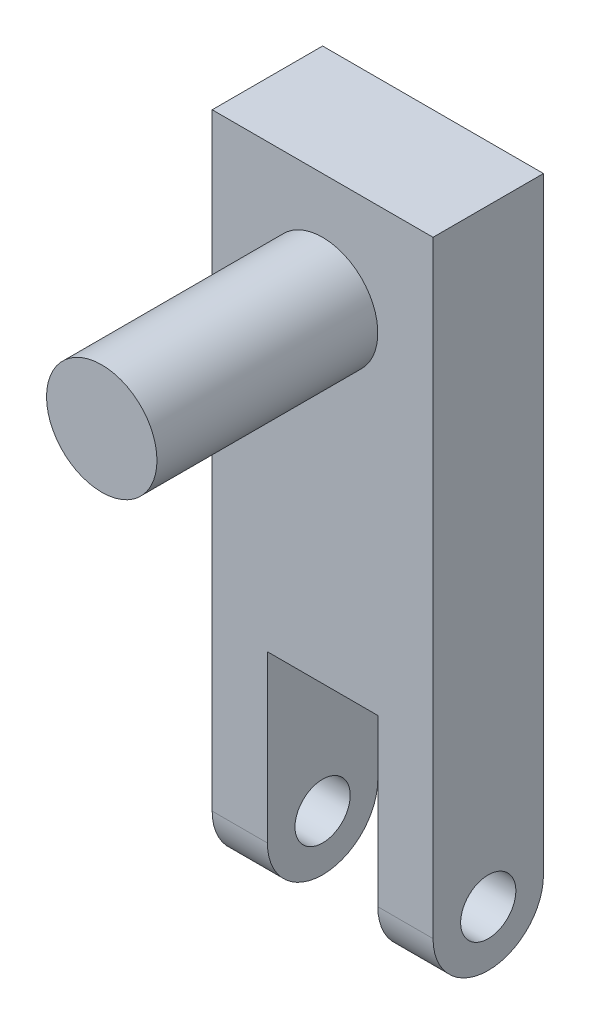
ISO-10303-21;
HEADER;
FILE_DESCRIPTION(('STEP AP214'),'2;1');
FILE_NAME('part.step','',(''),(''),'','','');
FILE_SCHEMA(('AUTOMOTIVE_DESIGN { 1 0 10303 214 1 1 1 1 }'));
ENDSEC;
DATA;
#1=APPLICATION_CONTEXT('core data for automotive mechanical design processes');
#2=APPLICATION_PROTOCOL_DEFINITION('international standard','automotive_design',2000,#1);
#3=PRODUCT_CONTEXT('',#1,'mechanical');
#4=PRODUCT('Part','Part','',(#3));
#5=PRODUCT_RELATED_PRODUCT_CATEGORY('part','',(#4));
#6=PRODUCT_DEFINITION_FORMATION('','',#4);
#7=PRODUCT_DEFINITION_CONTEXT('part definition',#1,'design');
#8=PRODUCT_DEFINITION('design','',#6,#7);
#9=PRODUCT_DEFINITION_SHAPE('','',#8);
#10=(LENGTH_UNIT() NAMED_UNIT(*) SI_UNIT(.MILLI.,.METRE.));
#11=(NAMED_UNIT(*) PLANE_ANGLE_UNIT() SI_UNIT($,.RADIAN.));
#12=(NAMED_UNIT(*) SI_UNIT($,.STERADIAN.) SOLID_ANGLE_UNIT());
#13=UNCERTAINTY_MEASURE_WITH_UNIT(LENGTH_MEASURE(1.E-05),#10,'distance_accuracy_value','');
#14=(GEOMETRIC_REPRESENTATION_CONTEXT(3) GLOBAL_UNCERTAINTY_ASSIGNED_CONTEXT((#13)) GLOBAL_UNIT_ASSIGNED_CONTEXT((#10,
#11,#12)) REPRESENTATION_CONTEXT('',''));
#15=CARTESIAN_POINT('',(0.,0.,0.));
#16=DIRECTION('',(0.,0.,1.));
#17=DIRECTION('',(1.,0.,0.));
#18=AXIS2_PLACEMENT_3D('',#15,#16,#17);
#19=CARTESIAN_POINT('',(-6.35,0.,6.35));
#20=DIRECTION('',(1.,0.,0.));
#21=DIRECTION('',(0.,0.,-1.));
#22=AXIS2_PLACEMENT_3D('',#19,#20,#21);
#23=PLANE('',#22);
#24=CARTESIAN_POINT('',(-6.35,3.175,3.175));
#25=DIRECTION('',(1.,0.,0.));
#26=DIRECTION('',(0.,0.,-1.));
#27=AXIS2_PLACEMENT_3D('',#24,#25,#26);
#28=CIRCLE('',#27,1.5875);
#29=CARTESIAN_POINT('',(-6.35,3.175,1.5875));
#30=VERTEX_POINT('',#29);
#31=EDGE_CURVE('E237',#30,#30,#28,.T.);
#32=ORIENTED_EDGE('',*,*,#31,.T.);
#33=EDGE_LOOP('',(#32));
#34=FACE_BOUND('',#33,.T.);
#35=DIRECTION('',(0.,-1.,0.));
#36=VECTOR('',#35,1.);
#37=CARTESIAN_POINT('',(-6.35,0.,0.));
#38=LINE('',#37,#36);
#39=CARTESIAN_POINT('',(-6.35,38.1,0.));
#40=VERTEX_POINT('',#39);
#41=CARTESIAN_POINT('',(-6.35,3.175,0.));
#42=VERTEX_POINT('',#41);
#43=EDGE_CURVE('E159',#40,#42,#38,.T.);
#44=ORIENTED_EDGE('',*,*,#43,.T.);
#45=CARTESIAN_POINT('',(-6.35,3.175,3.175));
#46=DIRECTION('',(1.,0.,0.));
#47=DIRECTION('',(0.,0.,-1.));
#48=AXIS2_PLACEMENT_3D('',#45,#46,#47);
#49=CIRCLE('',#48,3.175);
#50=CARTESIAN_POINT('',(-6.35,0.,3.175));
#51=VERTEX_POINT('',#50);
#52=EDGE_CURVE('E203',#42,#51,#49,.F.);
#53=ORIENTED_EDGE('',*,*,#52,.T.);
#54=CARTESIAN_POINT('',(-6.35,3.175,3.175));
#55=DIRECTION('',(1.,0.,0.));
#56=DIRECTION('',(0.,0.,-1.));
#57=AXIS2_PLACEMENT_3D('',#54,#55,#56);
#58=CIRCLE('',#57,3.175);
#59=CARTESIAN_POINT('',(-6.35,3.175,6.35));
#60=VERTEX_POINT('',#59);
#61=EDGE_CURVE('E200',#51,#60,#58,.F.);
#62=ORIENTED_EDGE('',*,*,#61,.T.);
#63=DIRECTION('',(0.,-1.,0.));
#64=VECTOR('',#63,1.);
#65=CARTESIAN_POINT('',(-6.35,0.,6.35));
#66=LINE('',#65,#64);
#67=CARTESIAN_POINT('',(-6.35,38.1,6.35));
#68=VERTEX_POINT('',#67);
#69=EDGE_CURVE('E129',#68,#60,#66,.T.);
#70=ORIENTED_EDGE('',*,*,#69,.F.);
#71=DIRECTION('',(0.,0.,-1.));
#72=VECTOR('',#71,1.);
#73=CARTESIAN_POINT('',(-6.35,38.1,6.35));
#74=LINE('',#73,#72);
#75=EDGE_CURVE('E158',#68,#40,#74,.T.);
#76=ORIENTED_EDGE('',*,*,#75,.T.);
#77=EDGE_LOOP('',(#44,#53,#62,#70,#76));
#78=FACE_BOUND('',#77,.T.);
#79=ADVANCED_FACE('F39',(#34,#78),#23,.F.);
#80=CARTESIAN_POINT('',(-3.175,0.,6.35));
#81=DIRECTION('',(-1.,0.,0.));
#82=DIRECTION('',(0.,0.,1.));
#83=AXIS2_PLACEMENT_3D('',#80,#81,#82);
#84=PLANE('',#83);
#85=CARTESIAN_POINT('',(-3.175,3.175,3.175));
#86=DIRECTION('',(-1.,0.,0.));
#87=DIRECTION('',(0.,0.,1.));
#88=AXIS2_PLACEMENT_3D('',#85,#86,#87);
#89=CIRCLE('',#88,1.5875);
#90=CARTESIAN_POINT('',(-3.175,3.175,4.7625));
#91=VERTEX_POINT('',#90);
#92=EDGE_CURVE('E226',#91,#91,#89,.T.);
#93=ORIENTED_EDGE('',*,*,#92,.T.);
#94=EDGE_LOOP('',(#93));
#95=FACE_BOUND('',#94,.T.);
#96=CARTESIAN_POINT('',(-3.175,3.175,3.175));
#97=DIRECTION('',(-1.,0.,0.));
#98=DIRECTION('',(0.,0.,1.));
#99=AXIS2_PLACEMENT_3D('',#96,#97,#98);
#100=CIRCLE('',#99,3.175);
#101=CARTESIAN_POINT('',(-3.175,3.175,6.35));
#102=VERTEX_POINT('',#101);
#103=CARTESIAN_POINT('',(-3.175,0.,3.175));
#104=VERTEX_POINT('',#103);
#105=EDGE_CURVE('E139',#102,#104,#100,.F.);
#106=ORIENTED_EDGE('',*,*,#105,.T.);
#107=CARTESIAN_POINT('',(-3.175,3.175,3.175));
#108=DIRECTION('',(-1.,0.,0.));
#109=DIRECTION('',(0.,0.,1.));
#110=AXIS2_PLACEMENT_3D('',#107,#108,#109);
#111=CIRCLE('',#110,3.175);
#112=CARTESIAN_POINT('',(-3.175,3.175,0.));
#113=VERTEX_POINT('',#112);
#114=EDGE_CURVE('E189',#104,#113,#111,.F.);
#115=ORIENTED_EDGE('',*,*,#114,.T.);
#116=DIRECTION('',(0.,1.,0.));
#117=VECTOR('',#116,1.);
#118=CARTESIAN_POINT('',(-3.175,0.,0.));
#119=LINE('',#118,#117);
#120=CARTESIAN_POINT('',(-3.175,12.7,0.));
#121=VERTEX_POINT('',#120);
#122=EDGE_CURVE('E135',#113,#121,#119,.T.);
#123=ORIENTED_EDGE('',*,*,#122,.T.);
#124=DIRECTION('',(0.,0.,-1.));
#125=VECTOR('',#124,1.);
#126=CARTESIAN_POINT('',(-3.175,12.7,6.35));
#127=LINE('',#126,#125);
#128=CARTESIAN_POINT('',(-3.175,12.7,6.35));
#129=VERTEX_POINT('',#128);
#130=EDGE_CURVE('E132',#129,#121,#127,.T.);
#131=ORIENTED_EDGE('',*,*,#130,.F.);
#132=DIRECTION('',(0.,1.,0.));
#133=VECTOR('',#132,1.);
#134=CARTESIAN_POINT('',(-3.175,0.,6.35));
#135=LINE('',#134,#133);
#136=EDGE_CURVE('E116',#102,#129,#135,.T.);
#137=ORIENTED_EDGE('',*,*,#136,.F.);
#138=EDGE_LOOP('',(#106,#115,#123,#131,#137));
#139=FACE_BOUND('',#138,.T.);
#140=ADVANCED_FACE('F133',(#95,#139),#84,.F.);
#141=CARTESIAN_POINT('',(-3.175,12.7,6.35));
#142=DIRECTION('',(0.,1.,0.));
#143=DIRECTION('',(-1.,0.,0.));
#144=AXIS2_PLACEMENT_3D('',#141,#142,#143);
#145=PLANE('',#144);
#146=DIRECTION('',(1.,0.,0.));
#147=VECTOR('',#146,1.);
#148=CARTESIAN_POINT('',(-3.175,12.7,0.));
#149=LINE('',#148,#147);
#150=CARTESIAN_POINT('',(3.175,12.7,0.));
#151=VERTEX_POINT('',#150);
#152=EDGE_CURVE('E166',#121,#151,#149,.T.);
#153=ORIENTED_EDGE('',*,*,#152,.T.);
#154=DIRECTION('',(0.,0.,-1.));
#155=VECTOR('',#154,1.);
#156=CARTESIAN_POINT('',(3.175,12.7,6.35));
#157=LINE('',#156,#155);
#158=CARTESIAN_POINT('',(3.175,12.7,6.35));
#159=VERTEX_POINT('',#158);
#160=EDGE_CURVE('E140',#159,#151,#157,.T.);
#161=ORIENTED_EDGE('',*,*,#160,.F.);
#162=DIRECTION('',(1.,0.,0.));
#163=VECTOR('',#162,1.);
#164=CARTESIAN_POINT('',(-3.175,12.7,6.35));
#165=LINE('',#164,#163);
#166=EDGE_CURVE('E122',#129,#159,#165,.T.);
#167=ORIENTED_EDGE('',*,*,#166,.F.);
#168=ORIENTED_EDGE('',*,*,#130,.T.);
#169=EDGE_LOOP('',(#153,#161,#167,#168));
#170=FACE_BOUND('',#169,.T.);
#171=ADVANCED_FACE('F142',(#170),#145,.F.);
#172=CARTESIAN_POINT('',(3.175,0.,6.35));
#173=DIRECTION('',(1.,0.,0.));
#174=DIRECTION('',(0.,0.,-1.));
#175=AXIS2_PLACEMENT_3D('',#172,#173,#174);
#176=PLANE('',#175);
#177=CARTESIAN_POINT('',(3.175,3.175,3.175));
#178=DIRECTION('',(1.,0.,0.));
#179=DIRECTION('',(0.,0.,-1.));
#180=AXIS2_PLACEMENT_3D('',#177,#178,#179);
#181=CIRCLE('',#180,1.5875);
#182=CARTESIAN_POINT('',(3.175,3.175,1.5875));
#183=VERTEX_POINT('',#182);
#184=EDGE_CURVE('E231',#183,#183,#181,.T.);
#185=ORIENTED_EDGE('',*,*,#184,.T.);
#186=EDGE_LOOP('',(#185));
#187=FACE_BOUND('',#186,.T.);
#188=DIRECTION('',(0.,-1.,0.));
#189=VECTOR('',#188,1.);
#190=CARTESIAN_POINT('',(3.175,0.,0.));
#191=LINE('',#190,#189);
#192=CARTESIAN_POINT('',(3.175,3.175,0.));
#193=VERTEX_POINT('',#192);
#194=EDGE_CURVE('E169',#151,#193,#191,.T.);
#195=ORIENTED_EDGE('',*,*,#194,.T.);
#196=CARTESIAN_POINT('',(3.175,3.175,3.175));
#197=DIRECTION('',(1.,0.,0.));
#198=DIRECTION('',(0.,0.,-1.));
#199=AXIS2_PLACEMENT_3D('',#196,#197,#198);
#200=CIRCLE('',#199,3.175);
#201=CARTESIAN_POINT('',(3.175,0.,3.175));
#202=VERTEX_POINT('',#201);
#203=EDGE_CURVE('E48',#193,#202,#200,.F.);
#204=ORIENTED_EDGE('',*,*,#203,.T.);
#205=CARTESIAN_POINT('',(3.175,3.175,3.175));
#206=DIRECTION('',(1.,0.,0.));
#207=DIRECTION('',(0.,0.,-1.));
#208=AXIS2_PLACEMENT_3D('',#205,#206,#207);
#209=CIRCLE('',#208,3.175);
#210=CARTESIAN_POINT('',(3.175,3.175,6.35));
#211=VERTEX_POINT('',#210);
#212=EDGE_CURVE('E216',#202,#211,#209,.F.);
#213=ORIENTED_EDGE('',*,*,#212,.T.);
#214=DIRECTION('',(0.,-1.,0.));
#215=VECTOR('',#214,1.);
#216=CARTESIAN_POINT('',(3.175,0.,6.35));
#217=LINE('',#216,#215);
#218=EDGE_CURVE('E146',#159,#211,#217,.T.);
#219=ORIENTED_EDGE('',*,*,#218,.F.);
#220=ORIENTED_EDGE('',*,*,#160,.T.);
#221=EDGE_LOOP('',(#195,#204,#213,#219,#220));
#222=FACE_BOUND('',#221,.T.);
#223=ADVANCED_FACE('F265',(#187,#222),#176,.F.);
#224=CARTESIAN_POINT('',(6.35,0.,6.35));
#225=DIRECTION('',(-1.,0.,0.));
#226=DIRECTION('',(0.,0.,1.));
#227=AXIS2_PLACEMENT_3D('',#224,#225,#226);
#228=PLANE('',#227);
#229=CARTESIAN_POINT('',(6.35,3.175,3.175));
#230=DIRECTION('',(1.,0.,0.));
#231=DIRECTION('',(0.,0.,-1.));
#232=AXIS2_PLACEMENT_3D('',#229,#230,#231);
#233=CIRCLE('',#232,1.5875);
#234=CARTESIAN_POINT('',(6.35,3.175,1.5875));
#235=VERTEX_POINT('',#234);
#236=EDGE_CURVE('E364',#235,#235,#233,.T.);
#237=ORIENTED_EDGE('',*,*,#236,.F.);
#238=EDGE_LOOP('',(#237));
#239=FACE_BOUND('',#238,.T.);
#240=CARTESIAN_POINT('',(6.35,3.175,3.175));
#241=DIRECTION('',(-1.,0.,0.));
#242=DIRECTION('',(0.,0.,1.));
#243=AXIS2_PLACEMENT_3D('',#240,#241,#242);
#244=CIRCLE('',#243,3.175);
#245=CARTESIAN_POINT('',(6.35,3.175,6.35));
#246=VERTEX_POINT('',#245);
#247=CARTESIAN_POINT('',(6.35,0.,3.175));
#248=VERTEX_POINT('',#247);
#249=EDGE_CURVE('E62',#246,#248,#244,.F.);
#250=ORIENTED_EDGE('',*,*,#249,.T.);
#251=CARTESIAN_POINT('',(6.35,3.175,3.175));
#252=DIRECTION('',(-1.,0.,0.));
#253=DIRECTION('',(0.,0.,1.));
#254=AXIS2_PLACEMENT_3D('',#251,#252,#253);
#255=CIRCLE('',#254,3.175);
#256=CARTESIAN_POINT('',(6.35,3.175,0.));
#257=VERTEX_POINT('',#256);
#258=EDGE_CURVE('E213',#248,#257,#255,.F.);
#259=ORIENTED_EDGE('',*,*,#258,.T.);
#260=DIRECTION('',(0.,1.,0.));
#261=VECTOR('',#260,1.);
#262=CARTESIAN_POINT('',(6.35,0.,0.));
#263=LINE('',#262,#261);
#264=CARTESIAN_POINT('',(6.35,38.1,0.));
#265=VERTEX_POINT('',#264);
#266=EDGE_CURVE('E172',#257,#265,#263,.T.);
#267=ORIENTED_EDGE('',*,*,#266,.T.);
#268=DIRECTION('',(0.,0.,-1.));
#269=VECTOR('',#268,1.);
#270=CARTESIAN_POINT('',(6.35,38.1,6.35));
#271=LINE('',#270,#269);
#272=CARTESIAN_POINT('',(6.35,38.1,6.35));
#273=VERTEX_POINT('',#272);
#274=EDGE_CURVE('E181',#273,#265,#271,.T.);
#275=ORIENTED_EDGE('',*,*,#274,.F.);
#276=DIRECTION('',(0.,1.,0.));
#277=VECTOR('',#276,1.);
#278=CARTESIAN_POINT('',(6.35,0.,6.35));
#279=LINE('',#278,#277);
#280=EDGE_CURVE('E149',#246,#273,#279,.T.);
#281=ORIENTED_EDGE('',*,*,#280,.F.);
#282=EDGE_LOOP('',(#250,#259,#267,#275,#281));
#283=FACE_BOUND('',#282,.T.);
#284=ADVANCED_FACE('F263',(#239,#283),#228,.F.);
#285=CARTESIAN_POINT('',(-6.35,38.1,6.35));
#286=DIRECTION('',(0.,-1.,0.));
#287=DIRECTION('',(0.,0.,-1.));
#288=AXIS2_PLACEMENT_3D('',#285,#286,#287);
#289=PLANE('',#288);
#290=DIRECTION('',(-1.,0.,0.));
#291=VECTOR('',#290,1.);
#292=CARTESIAN_POINT('',(-6.35,38.1,0.));
#293=LINE('',#292,#291);
#294=EDGE_CURVE('E175',#265,#40,#293,.T.);
#295=ORIENTED_EDGE('',*,*,#294,.T.);
#296=ORIENTED_EDGE('',*,*,#75,.F.);
#297=DIRECTION('',(-1.,0.,0.));
#298=VECTOR('',#297,1.);
#299=CARTESIAN_POINT('',(-6.35,38.1,6.35));
#300=LINE('',#299,#298);
#301=EDGE_CURVE('E155',#273,#68,#300,.T.);
#302=ORIENTED_EDGE('',*,*,#301,.F.);
#303=ORIENTED_EDGE('',*,*,#274,.T.);
#304=EDGE_LOOP('',(#295,#296,#302,#303));
#305=FACE_BOUND('',#304,.T.);
#306=ADVANCED_FACE('F261',(#305),#289,.F.);
#307=CARTESIAN_POINT('',(0.,0.,6.35));
#308=DIRECTION('',(0.,0.,-1.));
#309=DIRECTION('',(-1.,0.,0.));
#310=AXIS2_PLACEMENT_3D('',#307,#308,#309);
#311=PLANE('',#310);
#312=CARTESIAN_POINT('',(0.,31.75,6.35));
#313=DIRECTION('',(0.,0.,-1.));
#314=DIRECTION('',(-1.,0.,0.));
#315=AXIS2_PLACEMENT_3D('',#312,#313,#314);
#316=CIRCLE('',#315,3.175);
#317=CARTESIAN_POINT('',(-3.175,31.75,6.35));
#318=VERTEX_POINT('',#317);
#319=EDGE_CURVE('E11',#318,#318,#316,.F.);
#320=ORIENTED_EDGE('',*,*,#319,.F.);
#321=EDGE_LOOP('',(#320));
#322=FACE_BOUND('',#321,.T.);
#323=ORIENTED_EDGE('',*,*,#69,.T.);
#324=DIRECTION('',(1.,0.,0.));
#325=VECTOR('',#324,1.);
#326=CARTESIAN_POINT('',(0.,3.175,6.35));
#327=LINE('',#326,#325);
#328=EDGE_CURVE('E125',#60,#102,#327,.T.);
#329=ORIENTED_EDGE('',*,*,#328,.T.);
#330=ORIENTED_EDGE('',*,*,#136,.T.);
#331=ORIENTED_EDGE('',*,*,#166,.T.);
#332=ORIENTED_EDGE('',*,*,#218,.T.);
#333=DIRECTION('',(1.,0.,0.));
#334=VECTOR('',#333,1.);
#335=CARTESIAN_POINT('',(0.,3.175,6.35));
#336=LINE('',#335,#334);
#337=EDGE_CURVE('E206',#211,#246,#336,.T.);
#338=ORIENTED_EDGE('',*,*,#337,.T.);
#339=ORIENTED_EDGE('',*,*,#280,.T.);
#340=ORIENTED_EDGE('',*,*,#301,.T.);
#341=EDGE_LOOP('',(#323,#329,#330,#331,#332,#338,#339,#340));
#342=FACE_BOUND('',#341,.T.);
#343=ADVANCED_FACE('F119',(#322,#342),#311,.F.);
#344=CARTESIAN_POINT('',(0.,0.,0.));
#345=DIRECTION('',(0.,0.,-1.));
#346=DIRECTION('',(-1.,0.,0.));
#347=AXIS2_PLACEMENT_3D('',#344,#345,#346);
#348=PLANE('',#347);
#349=ORIENTED_EDGE('',*,*,#122,.F.);
#350=DIRECTION('',(1.,0.,0.));
#351=VECTOR('',#350,1.);
#352=CARTESIAN_POINT('',(-6.35,3.175,0.));
#353=LINE('',#352,#351);
#354=EDGE_CURVE('E196',#113,#42,#353,.F.);
#355=ORIENTED_EDGE('',*,*,#354,.T.);
#356=ORIENTED_EDGE('',*,*,#43,.F.);
#357=ORIENTED_EDGE('',*,*,#294,.F.);
#358=ORIENTED_EDGE('',*,*,#266,.F.);
#359=DIRECTION('',(1.,0.,0.));
#360=VECTOR('',#359,1.);
#361=CARTESIAN_POINT('',(3.175,3.175,0.));
#362=LINE('',#361,#360);
#363=EDGE_CURVE('E192',#257,#193,#362,.F.);
#364=ORIENTED_EDGE('',*,*,#363,.T.);
#365=ORIENTED_EDGE('',*,*,#194,.F.);
#366=ORIENTED_EDGE('',*,*,#152,.F.);
#367=EDGE_LOOP('',(#349,#355,#356,#357,#358,#364,#365,#366));
#368=FACE_BOUND('',#367,.T.);
#369=ADVANCED_FACE('F253',(#368),#348,.T.);
#370=CARTESIAN_POINT('',(0.,3.175,3.175));
#371=DIRECTION('',(1.,0.,0.));
#372=DIRECTION('',(0.,0.,-1.));
#373=AXIS2_PLACEMENT_3D('',#370,#371,#372);
#374=CYLINDRICAL_SURFACE('',#373,3.175);
#375=ORIENTED_EDGE('',*,*,#328,.F.);
#376=ORIENTED_EDGE('',*,*,#61,.F.);
#377=DIRECTION('',(1.,0.,0.));
#378=VECTOR('',#377,1.);
#379=CARTESIAN_POINT('',(-6.35,0.,3.175));
#380=LINE('',#379,#378);
#381=EDGE_CURVE('E163',#104,#51,#380,.F.);
#382=ORIENTED_EDGE('',*,*,#381,.F.);
#383=ORIENTED_EDGE('',*,*,#105,.F.);
#384=EDGE_LOOP('',(#375,#376,#382,#383));
#385=FACE_BOUND('',#384,.T.);
#386=ADVANCED_FACE('F247',(#385),#374,.T.);
#387=CARTESIAN_POINT('',(-6.35,3.175,3.175));
#388=DIRECTION('',(-1.,0.,0.));
#389=DIRECTION('',(0.,0.,1.));
#390=AXIS2_PLACEMENT_3D('',#387,#388,#389);
#391=CYLINDRICAL_SURFACE('',#390,3.175);
#392=ORIENTED_EDGE('',*,*,#52,.F.);
#393=ORIENTED_EDGE('',*,*,#354,.F.);
#394=ORIENTED_EDGE('',*,*,#114,.F.);
#395=ORIENTED_EDGE('',*,*,#381,.T.);
#396=EDGE_LOOP('',(#392,#393,#394,#395));
#397=FACE_BOUND('',#396,.T.);
#398=ADVANCED_FACE('F256',(#397),#391,.T.);
#399=CARTESIAN_POINT('',(0.,3.175,3.175));
#400=DIRECTION('',(1.,0.,0.));
#401=DIRECTION('',(0.,0.,-1.));
#402=AXIS2_PLACEMENT_3D('',#399,#400,#401);
#403=CYLINDRICAL_SURFACE('',#402,3.175);
#404=ORIENTED_EDGE('',*,*,#337,.F.);
#405=ORIENTED_EDGE('',*,*,#212,.F.);
#406=DIRECTION('',(1.,0.,0.));
#407=VECTOR('',#406,1.);
#408=CARTESIAN_POINT('',(3.175,0.,3.175));
#409=LINE('',#408,#407);
#410=EDGE_CURVE('E223',#248,#202,#409,.F.);
#411=ORIENTED_EDGE('',*,*,#410,.F.);
#412=ORIENTED_EDGE('',*,*,#249,.F.);
#413=EDGE_LOOP('',(#404,#405,#411,#412));
#414=FACE_BOUND('',#413,.T.);
#415=ADVANCED_FACE('F41',(#414),#403,.T.);
#416=CARTESIAN_POINT('',(3.175,3.175,3.175));
#417=DIRECTION('',(-1.,0.,0.));
#418=DIRECTION('',(0.,0.,1.));
#419=AXIS2_PLACEMENT_3D('',#416,#417,#418);
#420=CYLINDRICAL_SURFACE('',#419,3.175);
#421=ORIENTED_EDGE('',*,*,#203,.F.);
#422=ORIENTED_EDGE('',*,*,#363,.F.);
#423=ORIENTED_EDGE('',*,*,#258,.F.);
#424=ORIENTED_EDGE('',*,*,#410,.T.);
#425=EDGE_LOOP('',(#421,#422,#423,#424));
#426=FACE_BOUND('',#425,.T.);
#427=ADVANCED_FACE('F264',(#426),#420,.T.);
#428=CARTESIAN_POINT('',(-6.35,3.175,3.175));
#429=DIRECTION('',(1.,0.,0.));
#430=DIRECTION('',(0.,0.,-1.));
#431=AXIS2_PLACEMENT_3D('',#428,#429,#430);
#432=CYLINDRICAL_SURFACE('',#431,1.5875);
#433=ORIENTED_EDGE('',*,*,#236,.T.);
#434=EDGE_LOOP('',(#433));
#435=FACE_BOUND('',#434,.T.);
#436=ORIENTED_EDGE('',*,*,#184,.F.);
#437=EDGE_LOOP('',(#436));
#438=FACE_BOUND('',#437,.T.);
#439=ADVANCED_FACE('F273',(#435,#438),#432,.F.);
#440=ORIENTED_EDGE('',*,*,#31,.F.);
#441=EDGE_LOOP('',(#440));
#442=FACE_BOUND('',#441,.T.);
#443=ORIENTED_EDGE('',*,*,#92,.F.);
#444=EDGE_LOOP('',(#443));
#445=FACE_BOUND('',#444,.T.);
#446=ADVANCED_FACE('F333',(#442,#445),#432,.F.);
#447=CARTESIAN_POINT('',(0.,31.75,19.05));
#448=DIRECTION('',(0.,0.,-1.));
#449=DIRECTION('',(-1.,0.,0.));
#450=AXIS2_PLACEMENT_3D('',#447,#448,#449);
#451=CYLINDRICAL_SURFACE('',#450,3.175);
#452=CARTESIAN_POINT('',(0.,31.75,19.05));
#453=DIRECTION('',(0.,0.,1.));
#454=DIRECTION('',(1.,0.,0.));
#455=AXIS2_PLACEMENT_3D('',#452,#453,#454);
#456=CIRCLE('',#455,3.175);
#457=CARTESIAN_POINT('',(3.175,31.75,19.05));
#458=VERTEX_POINT('',#457);
#459=EDGE_CURVE('E367',#458,#458,#456,.T.);
#460=ORIENTED_EDGE('',*,*,#459,.F.);
#461=EDGE_LOOP('',(#460));
#462=FACE_BOUND('',#461,.T.);
#463=ORIENTED_EDGE('',*,*,#319,.T.);
#464=EDGE_LOOP('',(#463));
#465=FACE_BOUND('',#464,.T.);
#466=ADVANCED_FACE('F337',(#462,#465),#451,.T.);
#467=CARTESIAN_POINT('',(0.,31.75,19.05));
#468=DIRECTION('',(0.,0.,1.));
#469=DIRECTION('',(1.,0.,0.));
#470=AXIS2_PLACEMENT_3D('',#467,#468,#469);
#471=PLANE('',#470);
#472=ORIENTED_EDGE('',*,*,#459,.T.);
#473=EDGE_LOOP('',(#472));
#474=FACE_BOUND('',#473,.T.);
#475=ADVANCED_FACE('F342',(#474),#471,.T.);
#476=CLOSED_SHELL('',(#79,#140,#171,#223,#284,#306,#343,#369,#386,#398,#415,#427,#439,#446,#466,#475));
#477=MANIFOLD_SOLID_BREP('B2',#476);
#478=ADVANCED_BREP_SHAPE_REPRESENTATION('',(#18,#477),#14);
#479=SHAPE_DEFINITION_REPRESENTATION(#9,#478);
ENDSEC;
END-ISO-10303-21;
